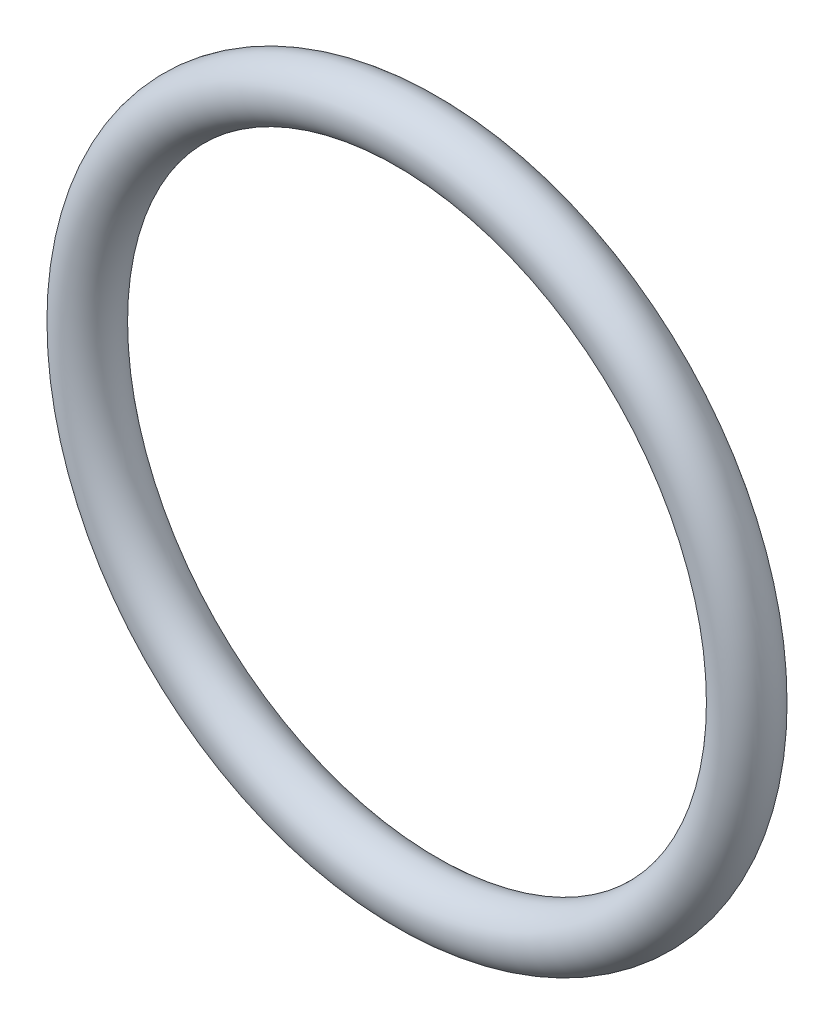
ISO-10303-21;
HEADER;
FILE_DESCRIPTION(('STEP AP214'),'2;1');
FILE_NAME('part.step','',(''),(''),'','','');
FILE_SCHEMA(('AUTOMOTIVE_DESIGN { 1 0 10303 214 1 1 1 1 }'));
ENDSEC;
DATA;
#1=APPLICATION_CONTEXT('core data for automotive mechanical design processes');
#2=APPLICATION_PROTOCOL_DEFINITION('international standard','automotive_design',2000,#1);
#3=PRODUCT_CONTEXT('',#1,'mechanical');
#4=PRODUCT('Part','Part','',(#3));
#5=PRODUCT_RELATED_PRODUCT_CATEGORY('part','',(#4));
#6=PRODUCT_DEFINITION_FORMATION('','',#4);
#7=PRODUCT_DEFINITION_CONTEXT('part definition',#1,'design');
#8=PRODUCT_DEFINITION('design','',#6,#7);
#9=PRODUCT_DEFINITION_SHAPE('','',#8);
#10=(LENGTH_UNIT() NAMED_UNIT(*) SI_UNIT(.MILLI.,.METRE.));
#11=(NAMED_UNIT(*) PLANE_ANGLE_UNIT() SI_UNIT($,.RADIAN.));
#12=(NAMED_UNIT(*) SI_UNIT($,.STERADIAN.) SOLID_ANGLE_UNIT());
#13=UNCERTAINTY_MEASURE_WITH_UNIT(LENGTH_MEASURE(1.E-05),#10,'distance_accuracy_value','');
#14=(GEOMETRIC_REPRESENTATION_CONTEXT(3) GLOBAL_UNCERTAINTY_ASSIGNED_CONTEXT((#13)) GLOBAL_UNIT_ASSIGNED_CONTEXT((#10,
#11,#12)) REPRESENTATION_CONTEXT('',''));
#15=CARTESIAN_POINT('',(0.,0.,0.));
#16=DIRECTION('',(0.,0.,1.));
#17=DIRECTION('',(1.,0.,0.));
#18=AXIS2_PLACEMENT_3D('',#15,#16,#17);
#19=CARTESIAN_POINT('',(0.,0.,0.));
#20=DIRECTION('',(0.,0.,1.));
#21=DIRECTION('',(1.,0.,0.));
#22=AXIS2_PLACEMENT_3D('',#19,#20,#21);
#23=TOROIDAL_SURFACE('',#22,10.2743,0.888999999999997);
#24=CARTESIAN_POINT('',(11.1633,0.,0.));
#25=VERTEX_POINT('',#24);
#26=VERTEX_LOOP('',#25);
#27=FACE_BOUND('',#26,.T.);
#28=ADVANCED_FACE('F34',(#27),#23,.T.);
#29=CLOSED_SHELL('',(#28));
#30=MANIFOLD_SOLID_BREP('B2',#29);
#31=ADVANCED_BREP_SHAPE_REPRESENTATION('',(#18,#30),#14);
#32=SHAPE_DEFINITION_REPRESENTATION(#9,#31);
ENDSEC;
END-ISO-10303-21;
